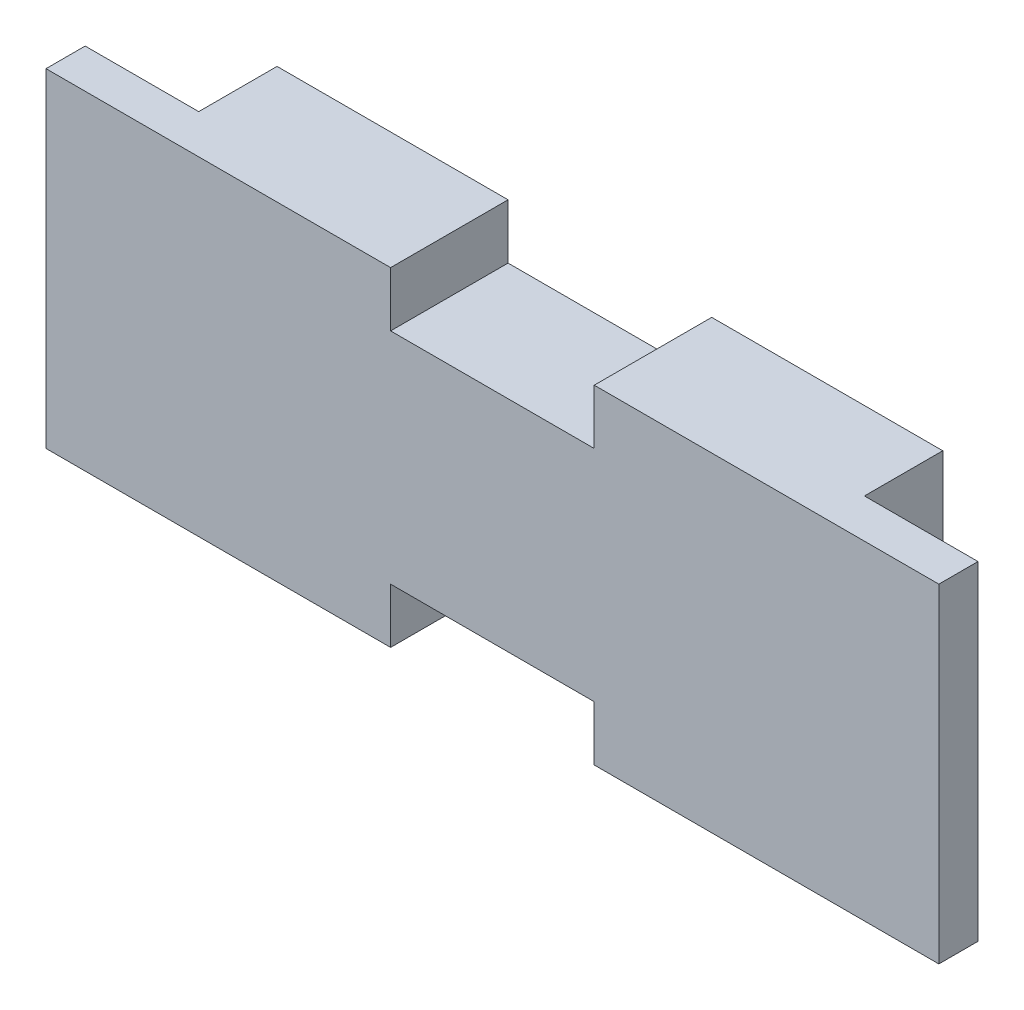
ISO-10303-21;
HEADER;
FILE_DESCRIPTION(('STEP AP214'),'2;1');
FILE_NAME('part.step','',(''),(''),'','','');
FILE_SCHEMA(('AUTOMOTIVE_DESIGN { 1 0 10303 214 1 1 1 1 }'));
ENDSEC;
DATA;
#1=APPLICATION_CONTEXT('core data for automotive mechanical design processes');
#2=APPLICATION_PROTOCOL_DEFINITION('international standard','automotive_design',2000,#1);
#3=PRODUCT_CONTEXT('',#1,'mechanical');
#4=PRODUCT('Part','Part','',(#3));
#5=PRODUCT_RELATED_PRODUCT_CATEGORY('part','',(#4));
#6=PRODUCT_DEFINITION_FORMATION('','',#4);
#7=PRODUCT_DEFINITION_CONTEXT('part definition',#1,'design');
#8=PRODUCT_DEFINITION('design','',#6,#7);
#9=PRODUCT_DEFINITION_SHAPE('','',#8);
#10=(LENGTH_UNIT() NAMED_UNIT(*) SI_UNIT(.MILLI.,.METRE.));
#11=(NAMED_UNIT(*) PLANE_ANGLE_UNIT() SI_UNIT($,.RADIAN.));
#12=(NAMED_UNIT(*) SI_UNIT($,.STERADIAN.) SOLID_ANGLE_UNIT());
#13=UNCERTAINTY_MEASURE_WITH_UNIT(LENGTH_MEASURE(1.E-05),#10,'distance_accuracy_value','');
#14=(GEOMETRIC_REPRESENTATION_CONTEXT(3) GLOBAL_UNCERTAINTY_ASSIGNED_CONTEXT((#13)) GLOBAL_UNIT_ASSIGNED_CONTEXT((#10,
#11,#12)) REPRESENTATION_CONTEXT('',''));
#15=CARTESIAN_POINT('',(0.,0.,0.));
#16=DIRECTION('',(0.,0.,1.));
#17=DIRECTION('',(1.,0.,0.));
#18=AXIS2_PLACEMENT_3D('',#15,#16,#17);
#19=CARTESIAN_POINT('',(-28.5,-10.5,2.5));
#20=DIRECTION('',(0.,1.,0.));
#21=DIRECTION('',(0.,0.,1.));
#22=AXIS2_PLACEMENT_3D('',#19,#20,#21);
#23=PLANE('',#22);
#24=DIRECTION('',(0.,0.,1.));
#25=VECTOR('',#24,1.);
#26=CARTESIAN_POINT('',(6.5,-10.5,-5.));
#27=LINE('',#26,#25);
#28=CARTESIAN_POINT('',(6.5,-10.5,-5.));
#29=VERTEX_POINT('',#28);
#30=CARTESIAN_POINT('',(6.5,-10.5,2.5));
#31=VERTEX_POINT('',#30);
#32=EDGE_CURVE('E175',#29,#31,#27,.T.);
#33=ORIENTED_EDGE('',*,*,#32,.F.);
#34=DIRECTION('',(-1.,0.,0.));
#35=VECTOR('',#34,1.);
#36=CARTESIAN_POINT('',(21.25,-10.5,-5.));
#37=LINE('',#36,#35);
#38=CARTESIAN_POINT('',(21.25,-10.5,-5.));
#39=VERTEX_POINT('',#38);
#40=EDGE_CURVE('E165',#39,#29,#37,.T.);
#41=ORIENTED_EDGE('',*,*,#40,.F.);
#42=DIRECTION('',(0.,0.,1.));
#43=VECTOR('',#42,1.);
#44=CARTESIAN_POINT('',(21.25,-10.5,-5.));
#45=LINE('',#44,#43);
#46=CARTESIAN_POINT('',(21.25,-10.5,0.));
#47=VERTEX_POINT('',#46);
#48=EDGE_CURVE('E225',#39,#47,#45,.T.);
#49=ORIENTED_EDGE('',*,*,#48,.T.);
#50=DIRECTION('',(1.,0.,0.));
#51=VECTOR('',#50,1.);
#52=CARTESIAN_POINT('',(-28.5,-10.5,0.));
#53=LINE('',#52,#51);
#54=CARTESIAN_POINT('',(28.5,-10.5,0.));
#55=VERTEX_POINT('',#54);
#56=EDGE_CURVE('E258',#47,#55,#53,.T.);
#57=ORIENTED_EDGE('',*,*,#56,.T.);
#58=DIRECTION('',(0.,0.,-1.));
#59=VECTOR('',#58,1.);
#60=CARTESIAN_POINT('',(28.5,-10.5,2.5));
#61=LINE('',#60,#59);
#62=CARTESIAN_POINT('',(28.5,-10.5,2.5));
#63=VERTEX_POINT('',#62);
#64=EDGE_CURVE('E249',#63,#55,#61,.T.);
#65=ORIENTED_EDGE('',*,*,#64,.F.);
#66=DIRECTION('',(1.,0.,0.));
#67=VECTOR('',#66,1.);
#68=CARTESIAN_POINT('',(-28.5,-10.5,2.5));
#69=LINE('',#68,#67);
#70=EDGE_CURVE('E245',#31,#63,#69,.T.);
#71=ORIENTED_EDGE('',*,*,#70,.F.);
#72=EDGE_LOOP('',(#33,#41,#49,#57,#65,#71));
#73=FACE_BOUND('',#72,.T.);
#74=ADVANCED_FACE('F33',(#73),#23,.F.);
#75=DIRECTION('',(0.,0.,1.));
#76=VECTOR('',#75,1.);
#77=CARTESIAN_POINT('',(-6.5,-10.5,-5.));
#78=LINE('',#77,#76);
#79=CARTESIAN_POINT('',(-6.5,-10.5,-5.));
#80=VERTEX_POINT('',#79);
#81=CARTESIAN_POINT('',(-6.5,-10.5,2.5));
#82=VERTEX_POINT('',#81);
#83=EDGE_CURVE('E178',#80,#82,#78,.T.);
#84=ORIENTED_EDGE('',*,*,#83,.T.);
#85=CARTESIAN_POINT('',(-28.5,-10.5,2.5));
#86=VERTEX_POINT('',#85);
#87=EDGE_CURVE('E246',#86,#82,#69,.T.);
#88=ORIENTED_EDGE('',*,*,#87,.F.);
#89=DIRECTION('',(0.,0.,-1.));
#90=VECTOR('',#89,1.);
#91=CARTESIAN_POINT('',(-28.5,-10.5,2.5));
#92=LINE('',#91,#90);
#93=CARTESIAN_POINT('',(-28.5,-10.5,0.));
#94=VERTEX_POINT('',#93);
#95=EDGE_CURVE('E263',#86,#94,#92,.T.);
#96=ORIENTED_EDGE('',*,*,#95,.T.);
#97=CARTESIAN_POINT('',(-21.25,-10.5,0.));
#98=VERTEX_POINT('',#97);
#99=EDGE_CURVE('E239',#94,#98,#53,.T.);
#100=ORIENTED_EDGE('',*,*,#99,.T.);
#101=DIRECTION('',(0.,0.,1.));
#102=VECTOR('',#101,1.);
#103=CARTESIAN_POINT('',(-21.25,-10.5,-5.));
#104=LINE('',#103,#102);
#105=CARTESIAN_POINT('',(-21.25,-10.5,-5.));
#106=VERTEX_POINT('',#105);
#107=EDGE_CURVE('E218',#106,#98,#104,.T.);
#108=ORIENTED_EDGE('',*,*,#107,.F.);
#109=EDGE_CURVE('E216',#80,#106,#37,.T.);
#110=ORIENTED_EDGE('',*,*,#109,.F.);
#111=EDGE_LOOP('',(#84,#88,#96,#100,#108,#110));
#112=FACE_BOUND('',#111,.T.);
#113=ADVANCED_FACE('F279',(#112),#23,.F.);
#114=CARTESIAN_POINT('',(0.,0.,2.5));
#115=DIRECTION('',(0.,0.,-1.));
#116=DIRECTION('',(-1.,0.,0.));
#117=AXIS2_PLACEMENT_3D('',#114,#115,#116);
#118=PLANE('',#117);
#119=DIRECTION('',(0.,-1.,0.));
#120=VECTOR('',#119,1.);
#121=CARTESIAN_POINT('',(6.5,-7.00000000000001,2.5));
#122=LINE('',#121,#120);
#123=CARTESIAN_POINT('',(6.5,-7.00000000000001,2.5));
#124=VERTEX_POINT('',#123);
#125=EDGE_CURVE('E159',#124,#31,#122,.T.);
#126=ORIENTED_EDGE('',*,*,#125,.T.);
#127=ORIENTED_EDGE('',*,*,#70,.T.);
#128=DIRECTION('',(0.,1.,0.));
#129=VECTOR('',#128,1.);
#130=CARTESIAN_POINT('',(28.5,-10.5,2.5));
#131=LINE('',#130,#129);
#132=CARTESIAN_POINT('',(28.5,10.5,2.5));
#133=VERTEX_POINT('',#132);
#134=EDGE_CURVE('E235',#63,#133,#131,.T.);
#135=ORIENTED_EDGE('',*,*,#134,.T.);
#136=DIRECTION('',(-1.,0.,0.));
#137=VECTOR('',#136,1.);
#138=CARTESIAN_POINT('',(-28.5,10.5,2.5));
#139=LINE('',#138,#137);
#140=CARTESIAN_POINT('',(6.5,10.5,2.5));
#141=VERTEX_POINT('',#140);
#142=EDGE_CURVE('E240',#133,#141,#139,.T.);
#143=ORIENTED_EDGE('',*,*,#142,.T.);
#144=DIRECTION('',(0.,1.,0.));
#145=VECTOR('',#144,1.);
#146=CARTESIAN_POINT('',(6.5,7.00000000000001,2.5));
#147=LINE('',#146,#145);
#148=CARTESIAN_POINT('',(6.5,7.00000000000001,2.5));
#149=VERTEX_POINT('',#148);
#150=EDGE_CURVE('E177',#149,#141,#147,.T.);
#151=ORIENTED_EDGE('',*,*,#150,.F.);
#152=DIRECTION('',(1.,0.,0.));
#153=VECTOR('',#152,1.);
#154=CARTESIAN_POINT('',(-6.5,7.00000000000001,2.5));
#155=LINE('',#154,#153);
#156=CARTESIAN_POINT('',(-6.5,7.00000000000001,2.5));
#157=VERTEX_POINT('',#156);
#158=EDGE_CURVE('E186',#157,#149,#155,.T.);
#159=ORIENTED_EDGE('',*,*,#158,.F.);
#160=DIRECTION('',(0.,-1.,0.));
#161=VECTOR('',#160,1.);
#162=CARTESIAN_POINT('',(-6.5,7.00000000000001,2.5));
#163=LINE('',#162,#161);
#164=CARTESIAN_POINT('',(-6.5,10.5,2.5));
#165=VERTEX_POINT('',#164);
#166=EDGE_CURVE('E192',#165,#157,#163,.T.);
#167=ORIENTED_EDGE('',*,*,#166,.F.);
#168=CARTESIAN_POINT('',(-28.5,10.5,2.5));
#169=VERTEX_POINT('',#168);
#170=EDGE_CURVE('E238',#165,#169,#139,.T.);
#171=ORIENTED_EDGE('',*,*,#170,.T.);
#172=DIRECTION('',(0.,-1.,0.));
#173=VECTOR('',#172,1.);
#174=CARTESIAN_POINT('',(-28.5,-10.5,2.5));
#175=LINE('',#174,#173);
#176=EDGE_CURVE('E243',#169,#86,#175,.T.);
#177=ORIENTED_EDGE('',*,*,#176,.T.);
#178=ORIENTED_EDGE('',*,*,#87,.T.);
#179=DIRECTION('',(0.,1.,0.));
#180=VECTOR('',#179,1.);
#181=CARTESIAN_POINT('',(-6.5,-7.00000000000001,2.5));
#182=LINE('',#181,#180);
#183=CARTESIAN_POINT('',(-6.5,-7.00000000000001,2.5));
#184=VERTEX_POINT('',#183);
#185=EDGE_CURVE('E166',#82,#184,#182,.T.);
#186=ORIENTED_EDGE('',*,*,#185,.T.);
#187=DIRECTION('',(1.,0.,0.));
#188=VECTOR('',#187,1.);
#189=CARTESIAN_POINT('',(-6.5,-7.00000000000001,2.5));
#190=LINE('',#189,#188);
#191=EDGE_CURVE('E169',#184,#124,#190,.T.);
#192=ORIENTED_EDGE('',*,*,#191,.T.);
#193=EDGE_LOOP('',(#126,#127,#135,#143,#151,#159,#167,#171,#177,#178,#186,#192));
#194=FACE_BOUND('',#193,.T.);
#195=ADVANCED_FACE('F288',(#194),#118,.F.);
#196=CARTESIAN_POINT('',(0.,0.,-5.));
#197=DIRECTION('',(0.,0.,1.));
#198=DIRECTION('',(1.,0.,0.));
#199=AXIS2_PLACEMENT_3D('',#196,#197,#198);
#200=PLANE('',#199);
#201=DIRECTION('',(0.,-1.,0.));
#202=VECTOR('',#201,1.);
#203=CARTESIAN_POINT('',(6.5,-7.00000000000001,-5.));
#204=LINE('',#203,#202);
#205=CARTESIAN_POINT('',(6.5,-7.00000000000001,-5.));
#206=VERTEX_POINT('',#205);
#207=EDGE_CURVE('E153',#206,#29,#204,.T.);
#208=ORIENTED_EDGE('',*,*,#207,.F.);
#209=DIRECTION('',(1.,0.,0.));
#210=VECTOR('',#209,1.);
#211=CARTESIAN_POINT('',(-6.5,-7.00000000000001,-5.));
#212=LINE('',#211,#210);
#213=CARTESIAN_POINT('',(-6.5,-7.00000000000001,-5.));
#214=VERTEX_POINT('',#213);
#215=EDGE_CURVE('E144',#214,#206,#212,.T.);
#216=ORIENTED_EDGE('',*,*,#215,.F.);
#217=DIRECTION('',(0.,1.,0.));
#218=VECTOR('',#217,1.);
#219=CARTESIAN_POINT('',(-6.5,-7.00000000000001,-5.));
#220=LINE('',#219,#218);
#221=EDGE_CURVE('E152',#80,#214,#220,.T.);
#222=ORIENTED_EDGE('',*,*,#221,.F.);
#223=ORIENTED_EDGE('',*,*,#109,.T.);
#224=DIRECTION('',(0.,1.,0.));
#225=VECTOR('',#224,1.);
#226=CARTESIAN_POINT('',(-21.25,-10.5,-5.));
#227=LINE('',#226,#225);
#228=CARTESIAN_POINT('',(-21.25,10.5,-5.));
#229=VERTEX_POINT('',#228);
#230=EDGE_CURVE('E206',#106,#229,#227,.T.);
#231=ORIENTED_EDGE('',*,*,#230,.T.);
#232=DIRECTION('',(1.,0.,0.));
#233=VECTOR('',#232,1.);
#234=CARTESIAN_POINT('',(21.25,10.5,-5.));
#235=LINE('',#234,#233);
#236=CARTESIAN_POINT('',(-6.5,10.5,-5.));
#237=VERTEX_POINT('',#236);
#238=EDGE_CURVE('E211',#229,#237,#235,.T.);
#239=ORIENTED_EDGE('',*,*,#238,.T.);
#240=DIRECTION('',(0.,-1.,0.));
#241=VECTOR('',#240,1.);
#242=CARTESIAN_POINT('',(-6.5,7.00000000000001,-5.));
#243=LINE('',#242,#241);
#244=CARTESIAN_POINT('',(-6.5,7.00000000000001,-5.));
#245=VERTEX_POINT('',#244);
#246=EDGE_CURVE('E185',#237,#245,#243,.T.);
#247=ORIENTED_EDGE('',*,*,#246,.T.);
#248=DIRECTION('',(1.,0.,0.));
#249=VECTOR('',#248,1.);
#250=CARTESIAN_POINT('',(-6.5,7.00000000000001,-5.));
#251=LINE('',#250,#249);
#252=CARTESIAN_POINT('',(6.5,7.00000000000001,-5.));
#253=VERTEX_POINT('',#252);
#254=EDGE_CURVE('E56',#245,#253,#251,.T.);
#255=ORIENTED_EDGE('',*,*,#254,.T.);
#256=DIRECTION('',(0.,1.,0.));
#257=VECTOR('',#256,1.);
#258=CARTESIAN_POINT('',(6.5,7.00000000000001,-5.));
#259=LINE('',#258,#257);
#260=CARTESIAN_POINT('',(6.5,10.5,-5.));
#261=VERTEX_POINT('',#260);
#262=EDGE_CURVE('E182',#253,#261,#259,.T.);
#263=ORIENTED_EDGE('',*,*,#262,.T.);
#264=CARTESIAN_POINT('',(21.25,10.5,-5.));
#265=VERTEX_POINT('',#264);
#266=EDGE_CURVE('E209',#261,#265,#235,.T.);
#267=ORIENTED_EDGE('',*,*,#266,.T.);
#268=DIRECTION('',(0.,-1.,0.));
#269=VECTOR('',#268,1.);
#270=CARTESIAN_POINT('',(21.25,-10.5,-5.));
#271=LINE('',#270,#269);
#272=EDGE_CURVE('E214',#265,#39,#271,.T.);
#273=ORIENTED_EDGE('',*,*,#272,.T.);
#274=ORIENTED_EDGE('',*,*,#40,.T.);
#275=EDGE_LOOP('',(#208,#216,#222,#223,#231,#239,#247,#255,#263,#267,#273,#274));
#276=FACE_BOUND('',#275,.T.);
#277=ADVANCED_FACE('F163',(#276),#200,.F.);
#278=CARTESIAN_POINT('',(-28.5,10.5,2.5));
#279=DIRECTION('',(0.,-1.,0.));
#280=DIRECTION('',(0.,0.,-1.));
#281=AXIS2_PLACEMENT_3D('',#278,#279,#280);
#282=PLANE('',#281);
#283=ORIENTED_EDGE('',*,*,#266,.F.);
#284=DIRECTION('',(0.,0.,1.));
#285=VECTOR('',#284,1.);
#286=CARTESIAN_POINT('',(6.5,10.5,-5.));
#287=LINE('',#286,#285);
#288=EDGE_CURVE('E190',#261,#141,#287,.T.);
#289=ORIENTED_EDGE('',*,*,#288,.T.);
#290=ORIENTED_EDGE('',*,*,#142,.F.);
#291=DIRECTION('',(0.,0.,-1.));
#292=VECTOR('',#291,1.);
#293=CARTESIAN_POINT('',(28.5,10.5,2.5));
#294=LINE('',#293,#292);
#295=CARTESIAN_POINT('',(28.5,10.5,0.));
#296=VERTEX_POINT('',#295);
#297=EDGE_CURVE('E11',#133,#296,#294,.T.);
#298=ORIENTED_EDGE('',*,*,#297,.T.);
#299=DIRECTION('',(-1.,0.,0.));
#300=VECTOR('',#299,1.);
#301=CARTESIAN_POINT('',(-28.5,10.5,0.));
#302=LINE('',#301,#300);
#303=CARTESIAN_POINT('',(21.25,10.5,0.));
#304=VERTEX_POINT('',#303);
#305=EDGE_CURVE('E253',#296,#304,#302,.T.);
#306=ORIENTED_EDGE('',*,*,#305,.T.);
#307=DIRECTION('',(0.,0.,1.));
#308=VECTOR('',#307,1.);
#309=CARTESIAN_POINT('',(21.25,10.5,-5.));
#310=LINE('',#309,#308);
#311=EDGE_CURVE('E228',#265,#304,#310,.T.);
#312=ORIENTED_EDGE('',*,*,#311,.F.);
#313=EDGE_LOOP('',(#283,#289,#290,#298,#306,#312));
#314=FACE_BOUND('',#313,.T.);
#315=ADVANCED_FACE('F300',(#314),#282,.F.);
#316=CARTESIAN_POINT('',(0.,0.,0.));
#317=DIRECTION('',(0.,0.,-1.));
#318=DIRECTION('',(-1.,0.,0.));
#319=AXIS2_PLACEMENT_3D('',#316,#317,#318);
#320=PLANE('',#319);
#321=DIRECTION('',(0.,1.,0.));
#322=VECTOR('',#321,1.);
#323=CARTESIAN_POINT('',(-21.25,-10.5,0.));
#324=LINE('',#323,#322);
#325=CARTESIAN_POINT('',(-21.25,10.5,0.));
#326=VERTEX_POINT('',#325);
#327=EDGE_CURVE('E199',#98,#326,#324,.T.);
#328=ORIENTED_EDGE('',*,*,#327,.F.);
#329=ORIENTED_EDGE('',*,*,#99,.F.);
#330=DIRECTION('',(0.,-1.,0.));
#331=VECTOR('',#330,1.);
#332=CARTESIAN_POINT('',(-28.5,-10.5,0.));
#333=LINE('',#332,#331);
#334=CARTESIAN_POINT('',(-28.5,10.5,0.));
#335=VERTEX_POINT('',#334);
#336=EDGE_CURVE('E256',#335,#94,#333,.T.);
#337=ORIENTED_EDGE('',*,*,#336,.F.);
#338=EDGE_CURVE('E252',#326,#335,#302,.T.);
#339=ORIENTED_EDGE('',*,*,#338,.F.);
#340=EDGE_LOOP('',(#328,#329,#337,#339));
#341=FACE_BOUND('',#340,.T.);
#342=ADVANCED_FACE('F276',(#341),#320,.T.);
#343=CARTESIAN_POINT('',(28.5,-10.5,2.5));
#344=DIRECTION('',(-1.,0.,0.));
#345=DIRECTION('',(0.,0.,1.));
#346=AXIS2_PLACEMENT_3D('',#343,#344,#345);
#347=PLANE('',#346);
#348=DIRECTION('',(0.,1.,0.));
#349=VECTOR('',#348,1.);
#350=CARTESIAN_POINT('',(28.5,-10.5,0.));
#351=LINE('',#350,#349);
#352=EDGE_CURVE('E234',#55,#296,#351,.T.);
#353=ORIENTED_EDGE('',*,*,#352,.T.);
#354=ORIENTED_EDGE('',*,*,#297,.F.);
#355=ORIENTED_EDGE('',*,*,#134,.F.);
#356=ORIENTED_EDGE('',*,*,#64,.T.);
#357=EDGE_LOOP('',(#353,#354,#355,#356));
#358=FACE_BOUND('',#357,.T.);
#359=ADVANCED_FACE('F35',(#358),#347,.F.);
#360=ORIENTED_EDGE('',*,*,#170,.F.);
#361=DIRECTION('',(0.,0.,1.));
#362=VECTOR('',#361,1.);
#363=CARTESIAN_POINT('',(-6.5,10.5,-5.));
#364=LINE('',#363,#362);
#365=EDGE_CURVE('E202',#237,#165,#364,.T.);
#366=ORIENTED_EDGE('',*,*,#365,.F.);
#367=ORIENTED_EDGE('',*,*,#238,.F.);
#368=DIRECTION('',(0.,0.,1.));
#369=VECTOR('',#368,1.);
#370=CARTESIAN_POINT('',(-21.25,10.5,-5.));
#371=LINE('',#370,#369);
#372=EDGE_CURVE('E231',#229,#326,#371,.T.);
#373=ORIENTED_EDGE('',*,*,#372,.T.);
#374=ORIENTED_EDGE('',*,*,#338,.T.);
#375=DIRECTION('',(0.,0.,-1.));
#376=VECTOR('',#375,1.);
#377=CARTESIAN_POINT('',(-28.5,10.5,2.5));
#378=LINE('',#377,#376);
#379=EDGE_CURVE('E41',#169,#335,#378,.T.);
#380=ORIENTED_EDGE('',*,*,#379,.F.);
#381=EDGE_LOOP('',(#360,#366,#367,#373,#374,#380));
#382=FACE_BOUND('',#381,.T.);
#383=ADVANCED_FACE('F292',(#382),#282,.F.);
#384=CARTESIAN_POINT('',(-28.5,-10.5,2.5));
#385=DIRECTION('',(1.,0.,0.));
#386=DIRECTION('',(0.,0.,-1.));
#387=AXIS2_PLACEMENT_3D('',#384,#385,#386);
#388=PLANE('',#387);
#389=ORIENTED_EDGE('',*,*,#336,.T.);
#390=ORIENTED_EDGE('',*,*,#95,.F.);
#391=ORIENTED_EDGE('',*,*,#176,.F.);
#392=ORIENTED_EDGE('',*,*,#379,.T.);
#393=EDGE_LOOP('',(#389,#390,#391,#392));
#394=FACE_BOUND('',#393,.T.);
#395=ADVANCED_FACE('F270',(#394),#388,.F.);
#396=DIRECTION('',(0.,-1.,0.));
#397=VECTOR('',#396,1.);
#398=CARTESIAN_POINT('',(21.25,-10.5,0.));
#399=LINE('',#398,#397);
#400=EDGE_CURVE('E210',#304,#47,#399,.T.);
#401=ORIENTED_EDGE('',*,*,#400,.F.);
#402=ORIENTED_EDGE('',*,*,#305,.F.);
#403=ORIENTED_EDGE('',*,*,#352,.F.);
#404=ORIENTED_EDGE('',*,*,#56,.F.);
#405=EDGE_LOOP('',(#401,#402,#403,#404));
#406=FACE_BOUND('',#405,.T.);
#407=ADVANCED_FACE('F332',(#406),#320,.T.);
#408=CARTESIAN_POINT('',(-21.25,-10.5,-5.));
#409=DIRECTION('',(1.,0.,0.));
#410=DIRECTION('',(0.,0.,-1.));
#411=AXIS2_PLACEMENT_3D('',#408,#409,#410);
#412=PLANE('',#411);
#413=ORIENTED_EDGE('',*,*,#327,.T.);
#414=ORIENTED_EDGE('',*,*,#372,.F.);
#415=ORIENTED_EDGE('',*,*,#230,.F.);
#416=ORIENTED_EDGE('',*,*,#107,.T.);
#417=EDGE_LOOP('',(#413,#414,#415,#416));
#418=FACE_BOUND('',#417,.T.);
#419=ADVANCED_FACE('F284',(#418),#412,.F.);
#420=CARTESIAN_POINT('',(21.25,-10.5,-5.));
#421=DIRECTION('',(-1.,0.,0.));
#422=DIRECTION('',(0.,0.,1.));
#423=AXIS2_PLACEMENT_3D('',#420,#421,#422);
#424=PLANE('',#423);
#425=ORIENTED_EDGE('',*,*,#400,.T.);
#426=ORIENTED_EDGE('',*,*,#48,.F.);
#427=ORIENTED_EDGE('',*,*,#272,.F.);
#428=ORIENTED_EDGE('',*,*,#311,.T.);
#429=EDGE_LOOP('',(#425,#426,#427,#428));
#430=FACE_BOUND('',#429,.T.);
#431=ADVANCED_FACE('F304',(#430),#424,.F.);
#432=CARTESIAN_POINT('',(6.5,7.00000000000001,-5.));
#433=DIRECTION('',(1.,0.,0.));
#434=DIRECTION('',(0.,0.,-1.));
#435=AXIS2_PLACEMENT_3D('',#432,#433,#434);
#436=PLANE('',#435);
#437=ORIENTED_EDGE('',*,*,#150,.T.);
#438=ORIENTED_EDGE('',*,*,#288,.F.);
#439=ORIENTED_EDGE('',*,*,#262,.F.);
#440=DIRECTION('',(0.,0.,1.));
#441=VECTOR('',#440,1.);
#442=CARTESIAN_POINT('',(6.5,7.00000000000001,-5.));
#443=LINE('',#442,#441);
#444=EDGE_CURVE('E197',#253,#149,#443,.T.);
#445=ORIENTED_EDGE('',*,*,#444,.T.);
#446=EDGE_LOOP('',(#437,#438,#439,#445));
#447=FACE_BOUND('',#446,.T.);
#448=ADVANCED_FACE('F313',(#447),#436,.F.);
#449=CARTESIAN_POINT('',(-6.5,7.00000000000001,-5.));
#450=DIRECTION('',(0.,-1.,0.));
#451=DIRECTION('',(0.,0.,-1.));
#452=AXIS2_PLACEMENT_3D('',#449,#450,#451);
#453=PLANE('',#452);
#454=ORIENTED_EDGE('',*,*,#158,.T.);
#455=ORIENTED_EDGE('',*,*,#444,.F.);
#456=ORIENTED_EDGE('',*,*,#254,.F.);
#457=DIRECTION('',(0.,0.,1.));
#458=VECTOR('',#457,1.);
#459=CARTESIAN_POINT('',(-6.5,7.00000000000001,-5.));
#460=LINE('',#459,#458);
#461=EDGE_CURVE('E200',#245,#157,#460,.T.);
#462=ORIENTED_EDGE('',*,*,#461,.T.);
#463=EDGE_LOOP('',(#454,#455,#456,#462));
#464=FACE_BOUND('',#463,.T.);
#465=ADVANCED_FACE('F314',(#464),#453,.F.);
#466=CARTESIAN_POINT('',(-6.5,7.00000000000001,-5.));
#467=DIRECTION('',(-1.,0.,0.));
#468=DIRECTION('',(0.,0.,1.));
#469=AXIS2_PLACEMENT_3D('',#466,#467,#468);
#470=PLANE('',#469);
#471=ORIENTED_EDGE('',*,*,#166,.T.);
#472=ORIENTED_EDGE('',*,*,#461,.F.);
#473=ORIENTED_EDGE('',*,*,#246,.F.);
#474=ORIENTED_EDGE('',*,*,#365,.T.);
#475=EDGE_LOOP('',(#471,#472,#473,#474));
#476=FACE_BOUND('',#475,.T.);
#477=ADVANCED_FACE('F294',(#476),#470,.F.);
#478=CARTESIAN_POINT('',(6.5,-7.00000000000001,-5.));
#479=DIRECTION('',(-1.,0.,0.));
#480=DIRECTION('',(0.,0.,1.));
#481=AXIS2_PLACEMENT_3D('',#478,#479,#480);
#482=PLANE('',#481);
#483=ORIENTED_EDGE('',*,*,#125,.F.);
#484=DIRECTION('',(0.,0.,1.));
#485=VECTOR('',#484,1.);
#486=CARTESIAN_POINT('',(6.5,-7.00000000000001,-5.));
#487=LINE('',#486,#485);
#488=EDGE_CURVE('E147',#206,#124,#487,.T.);
#489=ORIENTED_EDGE('',*,*,#488,.F.);
#490=ORIENTED_EDGE('',*,*,#207,.T.);
#491=ORIENTED_EDGE('',*,*,#32,.T.);
#492=EDGE_LOOP('',(#483,#489,#490,#491));
#493=FACE_BOUND('',#492,.T.);
#494=ADVANCED_FACE('F156',(#493),#482,.T.);
#495=CARTESIAN_POINT('',(-6.5,-7.00000000000001,-5.));
#496=DIRECTION('',(1.,0.,0.));
#497=DIRECTION('',(0.,0.,-1.));
#498=AXIS2_PLACEMENT_3D('',#495,#496,#497);
#499=PLANE('',#498);
#500=ORIENTED_EDGE('',*,*,#185,.F.);
#501=ORIENTED_EDGE('',*,*,#83,.F.);
#502=ORIENTED_EDGE('',*,*,#221,.T.);
#503=DIRECTION('',(0.,0.,1.));
#504=VECTOR('',#503,1.);
#505=CARTESIAN_POINT('',(-6.5,-7.00000000000001,-5.));
#506=LINE('',#505,#504);
#507=EDGE_CURVE('E48',#214,#184,#506,.T.);
#508=ORIENTED_EDGE('',*,*,#507,.T.);
#509=EDGE_LOOP('',(#500,#501,#502,#508));
#510=FACE_BOUND('',#509,.T.);
#511=ADVANCED_FACE('F446',(#510),#499,.T.);
#512=CARTESIAN_POINT('',(-6.5,-7.00000000000001,-5.));
#513=DIRECTION('',(0.,-1.,0.));
#514=DIRECTION('',(0.,0.,-1.));
#515=AXIS2_PLACEMENT_3D('',#512,#513,#514);
#516=PLANE('',#515);
#517=ORIENTED_EDGE('',*,*,#191,.F.);
#518=ORIENTED_EDGE('',*,*,#507,.F.);
#519=ORIENTED_EDGE('',*,*,#215,.T.);
#520=ORIENTED_EDGE('',*,*,#488,.T.);
#521=EDGE_LOOP('',(#517,#518,#519,#520));
#522=FACE_BOUND('',#521,.T.);
#523=ADVANCED_FACE('F146',(#522),#516,.T.);
#524=CLOSED_SHELL('',(#74,#113,#195,#277,#315,#342,#359,#383,#395,#407,#419,#431,#448,#465,#477,
#494,#511,#523));
#525=MANIFOLD_SOLID_BREP('B2',#524);
#526=ADVANCED_BREP_SHAPE_REPRESENTATION('',(#18,#525),#14);
#527=SHAPE_DEFINITION_REPRESENTATION(#9,#526);
ENDSEC;
END-ISO-10303-21;
